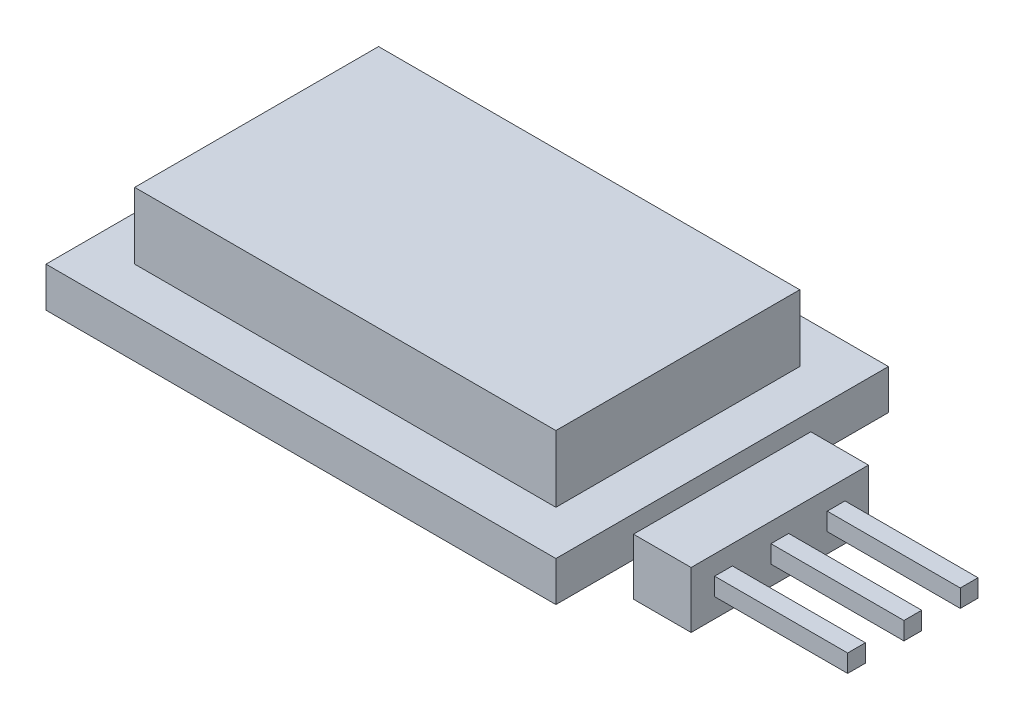
ISO-10303-21;
HEADER;
FILE_DESCRIPTION(('STEP AP214'),'2;1');
FILE_NAME('part.step','',(''),(''),'','','');
FILE_SCHEMA(('AUTOMOTIVE_DESIGN { 1 0 10303 214 1 1 1 1 }'));
ENDSEC;
DATA;
#1=APPLICATION_CONTEXT('core data for automotive mechanical design processes');
#2=APPLICATION_PROTOCOL_DEFINITION('international standard','automotive_design',2000,#1);
#3=PRODUCT_CONTEXT('',#1,'mechanical');
#4=PRODUCT('Part','Part','',(#3));
#5=PRODUCT_RELATED_PRODUCT_CATEGORY('part','',(#4));
#6=PRODUCT_DEFINITION_FORMATION('','',#4);
#7=PRODUCT_DEFINITION_CONTEXT('part definition',#1,'design');
#8=PRODUCT_DEFINITION('design','',#6,#7);
#9=PRODUCT_DEFINITION_SHAPE('','',#8);
#10=(LENGTH_UNIT() NAMED_UNIT(*) SI_UNIT(.MILLI.,.METRE.));
#11=(NAMED_UNIT(*) PLANE_ANGLE_UNIT() SI_UNIT($,.RADIAN.));
#12=(NAMED_UNIT(*) SI_UNIT($,.STERADIAN.) SOLID_ANGLE_UNIT());
#13=UNCERTAINTY_MEASURE_WITH_UNIT(LENGTH_MEASURE(1.E-05),#10,'distance_accuracy_value','');
#14=(GEOMETRIC_REPRESENTATION_CONTEXT(3) GLOBAL_UNCERTAINTY_ASSIGNED_CONTEXT((#13)) GLOBAL_UNIT_ASSIGNED_CONTEXT((#10,
#11,#12)) REPRESENTATION_CONTEXT('',''));
#15=CARTESIAN_POINT('',(0.,0.,0.));
#16=DIRECTION('',(0.,0.,1.));
#17=DIRECTION('',(1.,0.,0.));
#18=AXIS2_PLACEMENT_3D('',#15,#16,#17);
#19=CARTESIAN_POINT('',(25.6,0.,0.));
#20=DIRECTION('',(1.,0.,0.));
#21=DIRECTION('',(0.,0.,-1.));
#22=AXIS2_PLACEMENT_3D('',#19,#20,#21);
#23=PLANE('',#22);
#24=DIRECTION('',(0.,-1.,0.));
#25=VECTOR('',#24,1.);
#26=CARTESIAN_POINT('',(25.6,1.,-3.5));
#27=LINE('',#26,#25);
#28=CARTESIAN_POINT('',(25.6,1.,-3.5));
#29=VERTEX_POINT('',#28);
#30=CARTESIAN_POINT('',(25.6,-1.54,-3.5));
#31=VERTEX_POINT('',#30);
#32=EDGE_CURVE('E324',#29,#31,#27,.T.);
#33=ORIENTED_EDGE('',*,*,#32,.T.);
#34=DIRECTION('',(0.,0.,-1.));
#35=VECTOR('',#34,1.);
#36=CARTESIAN_POINT('',(25.6,-1.54,-3.5));
#37=LINE('',#36,#35);
#38=CARTESIAN_POINT('',(25.6,-1.54,-11.5));
#39=VERTEX_POINT('',#38);
#40=EDGE_CURVE('E328',#31,#39,#37,.T.);
#41=ORIENTED_EDGE('',*,*,#40,.T.);
#42=DIRECTION('',(0.,1.,0.));
#43=VECTOR('',#42,1.);
#44=CARTESIAN_POINT('',(25.6,1.,-11.5));
#45=LINE('',#44,#43);
#46=CARTESIAN_POINT('',(25.6,1.,-11.5));
#47=VERTEX_POINT('',#46);
#48=EDGE_CURVE('E332',#39,#47,#45,.T.);
#49=ORIENTED_EDGE('',*,*,#48,.T.);
#50=DIRECTION('',(0.,0.,1.));
#51=VECTOR('',#50,1.);
#52=CARTESIAN_POINT('',(25.6,1.,-3.5));
#53=LINE('',#52,#51);
#54=EDGE_CURVE('E335',#47,#29,#53,.T.);
#55=ORIENTED_EDGE('',*,*,#54,.T.);
#56=EDGE_LOOP('',(#33,#41,#49,#55));
#57=FACE_BOUND('',#56,.T.);
#58=DIRECTION('',(0.,0.,1.));
#59=VECTOR('',#58,1.);
#60=CARTESIAN_POINT('',(25.6,0.13,-7.1));
#61=LINE('',#60,#59);
#62=CARTESIAN_POINT('',(25.6,0.13,-7.9));
#63=VERTEX_POINT('',#62);
#64=CARTESIAN_POINT('',(25.6,0.13,-7.1));
#65=VERTEX_POINT('',#64);
#66=EDGE_CURVE('E301',#63,#65,#61,.T.);
#67=ORIENTED_EDGE('',*,*,#66,.F.);
#68=DIRECTION('',(0.,1.,0.));
#69=VECTOR('',#68,1.);
#70=CARTESIAN_POINT('',(25.6,0.13,-7.9));
#71=LINE('',#70,#69);
#72=CARTESIAN_POINT('',(25.6,-0.67,-7.9));
#73=VERTEX_POINT('',#72);
#74=EDGE_CURVE('E282',#73,#63,#71,.T.);
#75=ORIENTED_EDGE('',*,*,#74,.F.);
#76=DIRECTION('',(0.,0.,-1.));
#77=VECTOR('',#76,1.);
#78=CARTESIAN_POINT('',(25.6,-0.67,-7.1));
#79=LINE('',#78,#77);
#80=CARTESIAN_POINT('',(25.6,-0.67,-7.1));
#81=VERTEX_POINT('',#80);
#82=EDGE_CURVE('E288',#81,#73,#79,.T.);
#83=ORIENTED_EDGE('',*,*,#82,.F.);
#84=DIRECTION('',(0.,-1.,0.));
#85=VECTOR('',#84,1.);
#86=CARTESIAN_POINT('',(25.6,0.13,-7.1));
#87=LINE('',#86,#85);
#88=EDGE_CURVE('E304',#65,#81,#87,.T.);
#89=ORIENTED_EDGE('',*,*,#88,.F.);
#90=EDGE_LOOP('',(#67,#75,#83,#89));
#91=FACE_BOUND('',#90,.T.);
#92=DIRECTION('',(0.,1.,0.));
#93=VECTOR('',#92,1.);
#94=CARTESIAN_POINT('',(25.6,0.13,-10.44));
#95=LINE('',#94,#93);
#96=CARTESIAN_POINT('',(25.6,-0.67,-10.44));
#97=VERTEX_POINT('',#96);
#98=CARTESIAN_POINT('',(25.6,0.13,-10.44));
#99=VERTEX_POINT('',#98);
#100=EDGE_CURVE('E243',#97,#99,#95,.T.);
#101=ORIENTED_EDGE('',*,*,#100,.F.);
#102=DIRECTION('',(0.,0.,-1.));
#103=VECTOR('',#102,1.);
#104=CARTESIAN_POINT('',(25.6,-0.67,-9.64));
#105=LINE('',#104,#103);
#106=CARTESIAN_POINT('',(25.6,-0.67,-9.64));
#107=VERTEX_POINT('',#106);
#108=EDGE_CURVE('E238',#107,#97,#105,.T.);
#109=ORIENTED_EDGE('',*,*,#108,.F.);
#110=DIRECTION('',(0.,-1.,0.));
#111=VECTOR('',#110,1.);
#112=CARTESIAN_POINT('',(25.6,0.13,-9.64));
#113=LINE('',#112,#111);
#114=CARTESIAN_POINT('',(25.6,0.13,-9.64));
#115=VERTEX_POINT('',#114);
#116=EDGE_CURVE('E253',#115,#107,#113,.T.);
#117=ORIENTED_EDGE('',*,*,#116,.F.);
#118=DIRECTION('',(0.,0.,1.));
#119=VECTOR('',#118,1.);
#120=CARTESIAN_POINT('',(25.6,0.13,-9.64));
#121=LINE('',#120,#119);
#122=EDGE_CURVE('E265',#99,#115,#121,.T.);
#123=ORIENTED_EDGE('',*,*,#122,.F.);
#124=EDGE_LOOP('',(#101,#109,#117,#123));
#125=FACE_BOUND('',#124,.T.);
#126=DIRECTION('',(0.,1.,0.));
#127=VECTOR('',#126,1.);
#128=CARTESIAN_POINT('',(25.6,0.129999999999982,-5.36));
#129=LINE('',#128,#127);
#130=CARTESIAN_POINT('',(25.6,-0.670000000000018,-5.36));
#131=VERTEX_POINT('',#130);
#132=CARTESIAN_POINT('',(25.6,0.129999999999982,-5.36));
#133=VERTEX_POINT('',#132);
#134=EDGE_CURVE('E503',#131,#133,#129,.T.);
#135=ORIENTED_EDGE('',*,*,#134,.F.);
#136=DIRECTION('',(0.,0.,-1.));
#137=VECTOR('',#136,1.);
#138=CARTESIAN_POINT('',(25.6,-0.670000000000018,-4.56));
#139=LINE('',#138,#137);
#140=CARTESIAN_POINT('',(25.6,-0.670000000000018,-4.56));
#141=VERTEX_POINT('',#140);
#142=EDGE_CURVE('E235',#141,#131,#139,.T.);
#143=ORIENTED_EDGE('',*,*,#142,.F.);
#144=DIRECTION('',(0.,-1.,0.));
#145=VECTOR('',#144,1.);
#146=CARTESIAN_POINT('',(25.6,0.129999999999982,-4.56));
#147=LINE('',#146,#145);
#148=CARTESIAN_POINT('',(25.6,0.129999999999982,-4.56));
#149=VERTEX_POINT('',#148);
#150=EDGE_CURVE('E231',#149,#141,#147,.T.);
#151=ORIENTED_EDGE('',*,*,#150,.F.);
#152=DIRECTION('',(0.,0.,1.));
#153=VECTOR('',#152,1.);
#154=CARTESIAN_POINT('',(25.6,0.129999999999982,-4.56));
#155=LINE('',#154,#153);
#156=EDGE_CURVE('E505',#133,#149,#155,.T.);
#157=ORIENTED_EDGE('',*,*,#156,.F.);
#158=EDGE_LOOP('',(#135,#143,#151,#157));
#159=FACE_BOUND('',#158,.T.);
#160=ADVANCED_FACE('F39',(#57,#91,#125,#159),#23,.T.);
#161=CARTESIAN_POINT('',(23.,1.8,0.));
#162=DIRECTION('',(-1.,0.,0.));
#163=DIRECTION('',(0.,0.,1.));
#164=AXIS2_PLACEMENT_3D('',#161,#162,#163);
#165=PLANE('',#164);
#166=DIRECTION('',(0.,-1.,0.));
#167=VECTOR('',#166,1.);
#168=CARTESIAN_POINT('',(23.,1.,-3.5));
#169=LINE('',#168,#167);
#170=CARTESIAN_POINT('',(23.,1.,-3.5));
#171=VERTEX_POINT('',#170);
#172=CARTESIAN_POINT('',(23.,0.,-3.5));
#173=VERTEX_POINT('',#172);
#174=EDGE_CURVE('E339',#171,#173,#169,.T.);
#175=ORIENTED_EDGE('',*,*,#174,.F.);
#176=DIRECTION('',(0.,0.,1.));
#177=VECTOR('',#176,1.);
#178=CARTESIAN_POINT('',(23.,1.,-3.5));
#179=LINE('',#178,#177);
#180=CARTESIAN_POINT('',(23.,1.,-11.5));
#181=VERTEX_POINT('',#180);
#182=EDGE_CURVE('E329',#181,#171,#179,.T.);
#183=ORIENTED_EDGE('',*,*,#182,.F.);
#184=DIRECTION('',(0.,1.,0.));
#185=VECTOR('',#184,1.);
#186=CARTESIAN_POINT('',(23.,1.,-11.5));
#187=LINE('',#186,#185);
#188=CARTESIAN_POINT('',(23.,0.,-11.5));
#189=VERTEX_POINT('',#188);
#190=EDGE_CURVE('E11',#189,#181,#187,.T.);
#191=ORIENTED_EDGE('',*,*,#190,.F.);
#192=DIRECTION('',(0.,0.,-1.));
#193=VECTOR('',#192,1.);
#194=CARTESIAN_POINT('',(23.,0.,0.));
#195=LINE('',#194,#193);
#196=CARTESIAN_POINT('',(23.,0.,-15.));
#197=VERTEX_POINT('',#196);
#198=EDGE_CURVE('E433',#189,#197,#195,.T.);
#199=ORIENTED_EDGE('',*,*,#198,.T.);
#200=DIRECTION('',(0.,-1.,0.));
#201=VECTOR('',#200,1.);
#202=CARTESIAN_POINT('',(23.,1.8,-15.));
#203=LINE('',#202,#201);
#204=CARTESIAN_POINT('',(23.,1.8,-15.));
#205=VERTEX_POINT('',#204);
#206=EDGE_CURVE('E444',#205,#197,#203,.T.);
#207=ORIENTED_EDGE('',*,*,#206,.F.);
#208=DIRECTION('',(0.,0.,-1.));
#209=VECTOR('',#208,1.);
#210=CARTESIAN_POINT('',(23.,1.8,0.));
#211=LINE('',#210,#209);
#212=CARTESIAN_POINT('',(23.,1.8,0.));
#213=VERTEX_POINT('',#212);
#214=EDGE_CURVE('E420',#213,#205,#211,.T.);
#215=ORIENTED_EDGE('',*,*,#214,.F.);
#216=DIRECTION('',(0.,-1.,0.));
#217=VECTOR('',#216,1.);
#218=CARTESIAN_POINT('',(23.,1.8,0.));
#219=LINE('',#218,#217);
#220=CARTESIAN_POINT('',(23.,0.,0.));
#221=VERTEX_POINT('',#220);
#222=EDGE_CURVE('E447',#213,#221,#219,.T.);
#223=ORIENTED_EDGE('',*,*,#222,.T.);
#224=EDGE_CURVE('E434',#221,#173,#195,.T.);
#225=ORIENTED_EDGE('',*,*,#224,.T.);
#226=EDGE_LOOP('',(#175,#183,#191,#199,#207,#215,#223,#225));
#227=FACE_BOUND('',#226,.T.);
#228=ADVANCED_FACE('F469',(#227),#165,.F.);
#229=CARTESIAN_POINT('',(0.,1.8,0.));
#230=DIRECTION('',(0.,-1.,0.));
#231=DIRECTION('',(0.,0.,-1.));
#232=AXIS2_PLACEMENT_3D('',#229,#230,#231);
#233=PLANE('',#232);
#234=DIRECTION('',(0.,0.,1.));
#235=VECTOR('',#234,1.);
#236=CARTESIAN_POINT('',(0.,1.8,0.));
#237=LINE('',#236,#235);
#238=CARTESIAN_POINT('',(0.,1.8,-15.));
#239=VERTEX_POINT('',#238);
#240=CARTESIAN_POINT('',(0.,1.8,0.));
#241=VERTEX_POINT('',#240);
#242=EDGE_CURVE('E412',#239,#241,#237,.T.);
#243=ORIENTED_EDGE('',*,*,#242,.T.);
#244=DIRECTION('',(1.,0.,0.));
#245=VECTOR('',#244,1.);
#246=CARTESIAN_POINT('',(0.,1.8,0.));
#247=LINE('',#246,#245);
#248=EDGE_CURVE('E416',#241,#213,#247,.T.);
#249=ORIENTED_EDGE('',*,*,#248,.T.);
#250=ORIENTED_EDGE('',*,*,#214,.T.);
#251=DIRECTION('',(-1.,0.,0.));
#252=VECTOR('',#251,1.);
#253=CARTESIAN_POINT('',(0.,1.8,-15.));
#254=LINE('',#253,#252);
#255=EDGE_CURVE('E423',#205,#239,#254,.T.);
#256=ORIENTED_EDGE('',*,*,#255,.T.);
#257=EDGE_LOOP('',(#243,#249,#250,#256));
#258=FACE_BOUND('',#257,.T.);
#259=DIRECTION('',(0.,0.,1.));
#260=VECTOR('',#259,1.);
#261=CARTESIAN_POINT('',(2.,1.8,-2.));
#262=LINE('',#261,#260);
#263=CARTESIAN_POINT('',(2.,1.8,-13.));
#264=VERTEX_POINT('',#263);
#265=CARTESIAN_POINT('',(2.,1.8,-2.));
#266=VERTEX_POINT('',#265);
#267=EDGE_CURVE('E366',#264,#266,#262,.T.);
#268=ORIENTED_EDGE('',*,*,#267,.F.);
#269=DIRECTION('',(-1.,0.,0.));
#270=VECTOR('',#269,1.);
#271=CARTESIAN_POINT('',(2.,1.8,-13.));
#272=LINE('',#271,#270);
#273=CARTESIAN_POINT('',(21.,1.8,-13.));
#274=VERTEX_POINT('',#273);
#275=EDGE_CURVE('E372',#274,#264,#272,.T.);
#276=ORIENTED_EDGE('',*,*,#275,.F.);
#277=DIRECTION('',(0.,0.,-1.));
#278=VECTOR('',#277,1.);
#279=CARTESIAN_POINT('',(21.,1.8,-2.));
#280=LINE('',#279,#278);
#281=CARTESIAN_POINT('',(21.,1.8,-2.));
#282=VERTEX_POINT('',#281);
#283=EDGE_CURVE('E389',#282,#274,#280,.T.);
#284=ORIENTED_EDGE('',*,*,#283,.F.);
#285=DIRECTION('',(1.,0.,0.));
#286=VECTOR('',#285,1.);
#287=CARTESIAN_POINT('',(2.,1.8,-2.));
#288=LINE('',#287,#286);
#289=EDGE_CURVE('E385',#266,#282,#288,.T.);
#290=ORIENTED_EDGE('',*,*,#289,.F.);
#291=EDGE_LOOP('',(#268,#276,#284,#290));
#292=FACE_BOUND('',#291,.T.);
#293=ADVANCED_FACE('F607',(#258,#292),#233,.F.);
#294=CARTESIAN_POINT('',(0.,1.8,0.));
#295=DIRECTION('',(1.,0.,0.));
#296=DIRECTION('',(0.,0.,-1.));
#297=AXIS2_PLACEMENT_3D('',#294,#295,#296);
#298=PLANE('',#297);
#299=DIRECTION('',(0.,0.,1.));
#300=VECTOR('',#299,1.);
#301=CARTESIAN_POINT('',(0.,0.,0.));
#302=LINE('',#301,#300);
#303=CARTESIAN_POINT('',(0.,0.,-15.));
#304=VERTEX_POINT('',#303);
#305=CARTESIAN_POINT('',(0.,0.,0.));
#306=VERTEX_POINT('',#305);
#307=EDGE_CURVE('E411',#304,#306,#302,.T.);
#308=ORIENTED_EDGE('',*,*,#307,.T.);
#309=DIRECTION('',(0.,-1.,0.));
#310=VECTOR('',#309,1.);
#311=CARTESIAN_POINT('',(0.,1.8,0.));
#312=LINE('',#311,#310);
#313=EDGE_CURVE('E43',#241,#306,#312,.T.);
#314=ORIENTED_EDGE('',*,*,#313,.F.);
#315=ORIENTED_EDGE('',*,*,#242,.F.);
#316=DIRECTION('',(0.,-1.,0.));
#317=VECTOR('',#316,1.);
#318=CARTESIAN_POINT('',(0.,1.8,-15.));
#319=LINE('',#318,#317);
#320=EDGE_CURVE('E426',#239,#304,#319,.T.);
#321=ORIENTED_EDGE('',*,*,#320,.T.);
#322=EDGE_LOOP('',(#308,#314,#315,#321));
#323=FACE_BOUND('',#322,.T.);
#324=ADVANCED_FACE('F41',(#323),#298,.F.);
#325=CARTESIAN_POINT('',(0.,1.8,0.));
#326=DIRECTION('',(0.,0.,-1.));
#327=DIRECTION('',(-1.,0.,0.));
#328=AXIS2_PLACEMENT_3D('',#325,#326,#327);
#329=PLANE('',#328);
#330=DIRECTION('',(1.,0.,0.));
#331=VECTOR('',#330,1.);
#332=CARTESIAN_POINT('',(0.,0.,0.));
#333=LINE('',#332,#331);
#334=EDGE_CURVE('E430',#306,#221,#333,.T.);
#335=ORIENTED_EDGE('',*,*,#334,.T.);
#336=ORIENTED_EDGE('',*,*,#222,.F.);
#337=ORIENTED_EDGE('',*,*,#248,.F.);
#338=ORIENTED_EDGE('',*,*,#313,.T.);
#339=EDGE_LOOP('',(#335,#336,#337,#338));
#340=FACE_BOUND('',#339,.T.);
#341=ADVANCED_FACE('F458',(#340),#329,.F.);
#342=CARTESIAN_POINT('',(0.,1.8,-15.));
#343=DIRECTION('',(0.,0.,1.));
#344=DIRECTION('',(1.,0.,0.));
#345=AXIS2_PLACEMENT_3D('',#342,#343,#344);
#346=PLANE('',#345);
#347=DIRECTION('',(-1.,0.,0.));
#348=VECTOR('',#347,1.);
#349=CARTESIAN_POINT('',(0.,0.,-15.));
#350=LINE('',#349,#348);
#351=EDGE_CURVE('E417',#197,#304,#350,.T.);
#352=ORIENTED_EDGE('',*,*,#351,.T.);
#353=ORIENTED_EDGE('',*,*,#320,.F.);
#354=ORIENTED_EDGE('',*,*,#255,.F.);
#355=ORIENTED_EDGE('',*,*,#206,.T.);
#356=EDGE_LOOP('',(#352,#353,#354,#355));
#357=FACE_BOUND('',#356,.T.);
#358=ADVANCED_FACE('F613',(#357),#346,.F.);
#359=CARTESIAN_POINT('',(0.,0.,0.));
#360=DIRECTION('',(0.,-1.,0.));
#361=DIRECTION('',(0.,0.,-1.));
#362=AXIS2_PLACEMENT_3D('',#359,#360,#361);
#363=PLANE('',#362);
#364=ORIENTED_EDGE('',*,*,#307,.F.);
#365=ORIENTED_EDGE('',*,*,#351,.F.);
#366=ORIENTED_EDGE('',*,*,#198,.F.);
#367=EDGE_CURVE('E438',#173,#189,#195,.T.);
#368=ORIENTED_EDGE('',*,*,#367,.F.);
#369=ORIENTED_EDGE('',*,*,#224,.F.);
#370=ORIENTED_EDGE('',*,*,#334,.F.);
#371=EDGE_LOOP('',(#364,#365,#366,#368,#369,#370));
#372=FACE_BOUND('',#371,.T.);
#373=ADVANCED_FACE('F465',(#372),#363,.T.);
#374=CARTESIAN_POINT('',(2.,4.8,-2.));
#375=DIRECTION('',(1.,0.,0.));
#376=DIRECTION('',(0.,0.,-1.));
#377=AXIS2_PLACEMENT_3D('',#374,#375,#376);
#378=PLANE('',#377);
#379=ORIENTED_EDGE('',*,*,#267,.T.);
#380=DIRECTION('',(0.,-1.,0.));
#381=VECTOR('',#380,1.);
#382=CARTESIAN_POINT('',(2.,4.8,-2.));
#383=LINE('',#382,#381);
#384=CARTESIAN_POINT('',(2.,4.8,-2.));
#385=VERTEX_POINT('',#384);
#386=EDGE_CURVE('E407',#385,#266,#383,.T.);
#387=ORIENTED_EDGE('',*,*,#386,.F.);
#388=DIRECTION('',(0.,0.,1.));
#389=VECTOR('',#388,1.);
#390=CARTESIAN_POINT('',(2.,4.8,-2.));
#391=LINE('',#390,#389);
#392=CARTESIAN_POINT('',(2.,4.8,-13.));
#393=VERTEX_POINT('',#392);
#394=EDGE_CURVE('E367',#393,#385,#391,.T.);
#395=ORIENTED_EDGE('',*,*,#394,.F.);
#396=DIRECTION('',(0.,-1.,0.));
#397=VECTOR('',#396,1.);
#398=CARTESIAN_POINT('',(2.,4.8,-13.));
#399=LINE('',#398,#397);
#400=EDGE_CURVE('E381',#393,#264,#399,.T.);
#401=ORIENTED_EDGE('',*,*,#400,.T.);
#402=EDGE_LOOP('',(#379,#387,#395,#401));
#403=FACE_BOUND('',#402,.T.);
#404=ADVANCED_FACE('F602',(#403),#378,.F.);
#405=CARTESIAN_POINT('',(2.,4.8,-2.));
#406=DIRECTION('',(0.,0.,-1.));
#407=DIRECTION('',(-1.,0.,0.));
#408=AXIS2_PLACEMENT_3D('',#405,#406,#407);
#409=PLANE('',#408);
#410=ORIENTED_EDGE('',*,*,#289,.T.);
#411=DIRECTION('',(0.,-1.,0.));
#412=VECTOR('',#411,1.);
#413=CARTESIAN_POINT('',(21.,4.8,-2.));
#414=LINE('',#413,#412);
#415=CARTESIAN_POINT('',(21.,4.8,-2.));
#416=VERTEX_POINT('',#415);
#417=EDGE_CURVE('E403',#416,#282,#414,.T.);
#418=ORIENTED_EDGE('',*,*,#417,.F.);
#419=DIRECTION('',(1.,0.,0.));
#420=VECTOR('',#419,1.);
#421=CARTESIAN_POINT('',(2.,4.8,-2.));
#422=LINE('',#421,#420);
#423=EDGE_CURVE('E371',#385,#416,#422,.T.);
#424=ORIENTED_EDGE('',*,*,#423,.F.);
#425=ORIENTED_EDGE('',*,*,#386,.T.);
#426=EDGE_LOOP('',(#410,#418,#424,#425));
#427=FACE_BOUND('',#426,.T.);
#428=ADVANCED_FACE('F598',(#427),#409,.F.);
#429=CARTESIAN_POINT('',(21.,4.8,-2.));
#430=DIRECTION('',(-1.,0.,0.));
#431=DIRECTION('',(0.,0.,1.));
#432=AXIS2_PLACEMENT_3D('',#429,#430,#431);
#433=PLANE('',#432);
#434=ORIENTED_EDGE('',*,*,#283,.T.);
#435=DIRECTION('',(0.,-1.,0.));
#436=VECTOR('',#435,1.);
#437=CARTESIAN_POINT('',(21.,4.8,-13.));
#438=LINE('',#437,#436);
#439=CARTESIAN_POINT('',(21.,4.8,-13.));
#440=VERTEX_POINT('',#439);
#441=EDGE_CURVE('E399',#440,#274,#438,.T.);
#442=ORIENTED_EDGE('',*,*,#441,.F.);
#443=DIRECTION('',(0.,0.,-1.));
#444=VECTOR('',#443,1.);
#445=CARTESIAN_POINT('',(21.,4.8,-2.));
#446=LINE('',#445,#444);
#447=EDGE_CURVE('E375',#416,#440,#446,.T.);
#448=ORIENTED_EDGE('',*,*,#447,.F.);
#449=ORIENTED_EDGE('',*,*,#417,.T.);
#450=EDGE_LOOP('',(#434,#442,#448,#449));
#451=FACE_BOUND('',#450,.T.);
#452=ADVANCED_FACE('F594',(#451),#433,.F.);
#453=CARTESIAN_POINT('',(2.,4.8,-13.));
#454=DIRECTION('',(0.,0.,1.));
#455=DIRECTION('',(1.,0.,0.));
#456=AXIS2_PLACEMENT_3D('',#453,#454,#455);
#457=PLANE('',#456);
#458=ORIENTED_EDGE('',*,*,#275,.T.);
#459=ORIENTED_EDGE('',*,*,#400,.F.);
#460=DIRECTION('',(-1.,0.,0.));
#461=VECTOR('',#460,1.);
#462=CARTESIAN_POINT('',(2.,4.8,-13.));
#463=LINE('',#462,#461);
#464=EDGE_CURVE('E378',#440,#393,#463,.T.);
#465=ORIENTED_EDGE('',*,*,#464,.F.);
#466=ORIENTED_EDGE('',*,*,#441,.T.);
#467=EDGE_LOOP('',(#458,#459,#465,#466));
#468=FACE_BOUND('',#467,.T.);
#469=ADVANCED_FACE('F590',(#468),#457,.F.);
#470=CARTESIAN_POINT('',(0.,4.8,0.));
#471=DIRECTION('',(0.,-1.,0.));
#472=DIRECTION('',(0.,0.,-1.));
#473=AXIS2_PLACEMENT_3D('',#470,#471,#472);
#474=PLANE('',#473);
#475=ORIENTED_EDGE('',*,*,#394,.T.);
#476=ORIENTED_EDGE('',*,*,#423,.T.);
#477=ORIENTED_EDGE('',*,*,#447,.T.);
#478=ORIENTED_EDGE('',*,*,#464,.T.);
#479=EDGE_LOOP('',(#475,#476,#477,#478));
#480=FACE_BOUND('',#479,.T.);
#481=ADVANCED_FACE('F579',(#480),#474,.F.);
#482=CARTESIAN_POINT('',(23.,0.,0.));
#483=DIRECTION('',(1.,0.,0.));
#484=DIRECTION('',(0.,0.,-1.));
#485=AXIS2_PLACEMENT_3D('',#482,#483,#484);
#486=PLANE('',#485);
#487=CARTESIAN_POINT('',(23.,-1.54,-3.5));
#488=VERTEX_POINT('',#487);
#489=EDGE_CURVE('E323',#173,#488,#169,.T.);
#490=ORIENTED_EDGE('',*,*,#489,.F.);
#491=ORIENTED_EDGE('',*,*,#367,.T.);
#492=CARTESIAN_POINT('',(23.,-1.54,-11.5));
#493=VERTEX_POINT('',#492);
#494=EDGE_CURVE('E50',#493,#189,#187,.T.);
#495=ORIENTED_EDGE('',*,*,#494,.F.);
#496=DIRECTION('',(0.,0.,-1.));
#497=VECTOR('',#496,1.);
#498=CARTESIAN_POINT('',(23.,-1.54,-3.5));
#499=LINE('',#498,#497);
#500=EDGE_CURVE('E343',#488,#493,#499,.T.);
#501=ORIENTED_EDGE('',*,*,#500,.F.);
#502=EDGE_LOOP('',(#490,#491,#495,#501));
#503=FACE_BOUND('',#502,.T.);
#504=ADVANCED_FACE('F472',(#503),#486,.F.);
#505=CARTESIAN_POINT('',(25.6,1.,-3.5));
#506=DIRECTION('',(0.,0.,-1.));
#507=DIRECTION('',(0.,1.,0.));
#508=AXIS2_PLACEMENT_3D('',#505,#506,#507);
#509=PLANE('',#508);
#510=ORIENTED_EDGE('',*,*,#174,.T.);
#511=ORIENTED_EDGE('',*,*,#489,.T.);
#512=DIRECTION('',(-1.,0.,0.));
#513=VECTOR('',#512,1.);
#514=CARTESIAN_POINT('',(25.6,-1.54,-3.5));
#515=LINE('',#514,#513);
#516=EDGE_CURVE('E362',#31,#488,#515,.T.);
#517=ORIENTED_EDGE('',*,*,#516,.F.);
#518=ORIENTED_EDGE('',*,*,#32,.F.);
#519=DIRECTION('',(-1.,0.,0.));
#520=VECTOR('',#519,1.);
#521=CARTESIAN_POINT('',(25.6,1.,-3.5));
#522=LINE('',#521,#520);
#523=EDGE_CURVE('E338',#29,#171,#522,.T.);
#524=ORIENTED_EDGE('',*,*,#523,.T.);
#525=EDGE_LOOP('',(#510,#511,#517,#518,#524));
#526=FACE_BOUND('',#525,.T.);
#527=ADVANCED_FACE('F477',(#526),#509,.F.);
#528=CARTESIAN_POINT('',(25.6,-1.54,-3.5));
#529=DIRECTION('',(0.,1.,0.));
#530=DIRECTION('',(0.,0.,1.));
#531=AXIS2_PLACEMENT_3D('',#528,#529,#530);
#532=PLANE('',#531);
#533=ORIENTED_EDGE('',*,*,#500,.T.);
#534=DIRECTION('',(-1.,0.,0.));
#535=VECTOR('',#534,1.);
#536=CARTESIAN_POINT('',(25.6,-1.54,-11.5));
#537=LINE('',#536,#535);
#538=EDGE_CURVE('E358',#39,#493,#537,.T.);
#539=ORIENTED_EDGE('',*,*,#538,.F.);
#540=ORIENTED_EDGE('',*,*,#40,.F.);
#541=ORIENTED_EDGE('',*,*,#516,.T.);
#542=EDGE_LOOP('',(#533,#539,#540,#541));
#543=FACE_BOUND('',#542,.T.);
#544=ADVANCED_FACE('F489',(#543),#532,.F.);
#545=CARTESIAN_POINT('',(25.6,1.,-11.5));
#546=DIRECTION('',(0.,0.,1.));
#547=DIRECTION('',(1.,0.,0.));
#548=AXIS2_PLACEMENT_3D('',#545,#546,#547);
#549=PLANE('',#548);
#550=ORIENTED_EDGE('',*,*,#494,.T.);
#551=ORIENTED_EDGE('',*,*,#190,.T.);
#552=DIRECTION('',(-1.,0.,0.));
#553=VECTOR('',#552,1.);
#554=CARTESIAN_POINT('',(25.6,1.,-11.5));
#555=LINE('',#554,#553);
#556=EDGE_CURVE('E354',#47,#181,#555,.T.);
#557=ORIENTED_EDGE('',*,*,#556,.F.);
#558=ORIENTED_EDGE('',*,*,#48,.F.);
#559=ORIENTED_EDGE('',*,*,#538,.T.);
#560=EDGE_LOOP('',(#550,#551,#557,#558,#559));
#561=FACE_BOUND('',#560,.T.);
#562=ADVANCED_FACE('F485',(#561),#549,.F.);
#563=CARTESIAN_POINT('',(25.6,1.,-3.5));
#564=DIRECTION('',(0.,-1.,0.));
#565=DIRECTION('',(0.,0.,-1.));
#566=AXIS2_PLACEMENT_3D('',#563,#564,#565);
#567=PLANE('',#566);
#568=ORIENTED_EDGE('',*,*,#182,.T.);
#569=ORIENTED_EDGE('',*,*,#523,.F.);
#570=ORIENTED_EDGE('',*,*,#54,.F.);
#571=ORIENTED_EDGE('',*,*,#556,.T.);
#572=EDGE_LOOP('',(#568,#569,#570,#571));
#573=FACE_BOUND('',#572,.T.);
#574=ADVANCED_FACE('F482',(#573),#567,.F.);
#575=CARTESIAN_POINT('',(31.6,0.13,-7.9));
#576=DIRECTION('',(0.,0.,1.));
#577=DIRECTION('',(1.,0.,0.));
#578=AXIS2_PLACEMENT_3D('',#575,#576,#577);
#579=PLANE('',#578);
#580=ORIENTED_EDGE('',*,*,#74,.T.);
#581=DIRECTION('',(-1.,0.,0.));
#582=VECTOR('',#581,1.);
#583=CARTESIAN_POINT('',(31.6,0.13,-7.9));
#584=LINE('',#583,#582);
#585=CARTESIAN_POINT('',(31.6,0.13,-7.9));
#586=VERTEX_POINT('',#585);
#587=EDGE_CURVE('E320',#586,#63,#584,.T.);
#588=ORIENTED_EDGE('',*,*,#587,.F.);
#589=DIRECTION('',(0.,1.,0.));
#590=VECTOR('',#589,1.);
#591=CARTESIAN_POINT('',(31.6,0.13,-7.9));
#592=LINE('',#591,#590);
#593=CARTESIAN_POINT('',(31.6,-0.67,-7.9));
#594=VERTEX_POINT('',#593);
#595=EDGE_CURVE('E283',#594,#586,#592,.T.);
#596=ORIENTED_EDGE('',*,*,#595,.F.);
#597=DIRECTION('',(-1.,0.,0.));
#598=VECTOR('',#597,1.);
#599=CARTESIAN_POINT('',(31.6,-0.67,-7.9));
#600=LINE('',#599,#598);
#601=EDGE_CURVE('E297',#594,#73,#600,.T.);
#602=ORIENTED_EDGE('',*,*,#601,.T.);
#603=EDGE_LOOP('',(#580,#588,#596,#602));
#604=FACE_BOUND('',#603,.T.);
#605=ADVANCED_FACE('F572',(#604),#579,.F.);
#606=CARTESIAN_POINT('',(31.6,0.13,-7.1));
#607=DIRECTION('',(0.,-1.,0.));
#608=DIRECTION('',(0.,0.,-1.));
#609=AXIS2_PLACEMENT_3D('',#606,#607,#608);
#610=PLANE('',#609);
#611=ORIENTED_EDGE('',*,*,#66,.T.);
#612=DIRECTION('',(-1.,0.,0.));
#613=VECTOR('',#612,1.);
#614=CARTESIAN_POINT('',(31.6,0.13,-7.1));
#615=LINE('',#614,#613);
#616=CARTESIAN_POINT('',(31.6,0.13,-7.1));
#617=VERTEX_POINT('',#616);
#618=EDGE_CURVE('E316',#617,#65,#615,.T.);
#619=ORIENTED_EDGE('',*,*,#618,.F.);
#620=DIRECTION('',(0.,0.,1.));
#621=VECTOR('',#620,1.);
#622=CARTESIAN_POINT('',(31.6,0.13,-7.1));
#623=LINE('',#622,#621);
#624=EDGE_CURVE('E287',#586,#617,#623,.T.);
#625=ORIENTED_EDGE('',*,*,#624,.F.);
#626=ORIENTED_EDGE('',*,*,#587,.T.);
#627=EDGE_LOOP('',(#611,#619,#625,#626));
#628=FACE_BOUND('',#627,.T.);
#629=ADVANCED_FACE('F568',(#628),#610,.F.);
#630=CARTESIAN_POINT('',(31.6,0.13,-7.1));
#631=DIRECTION('',(0.,0.,-1.));
#632=DIRECTION('',(-1.,0.,0.));
#633=AXIS2_PLACEMENT_3D('',#630,#631,#632);
#634=PLANE('',#633);
#635=ORIENTED_EDGE('',*,*,#88,.T.);
#636=DIRECTION('',(-1.,0.,0.));
#637=VECTOR('',#636,1.);
#638=CARTESIAN_POINT('',(31.6,-0.67,-7.1));
#639=LINE('',#638,#637);
#640=CARTESIAN_POINT('',(31.6,-0.67,-7.1));
#641=VERTEX_POINT('',#640);
#642=EDGE_CURVE('E313',#641,#81,#639,.T.);
#643=ORIENTED_EDGE('',*,*,#642,.F.);
#644=DIRECTION('',(0.,-1.,0.));
#645=VECTOR('',#644,1.);
#646=CARTESIAN_POINT('',(31.6,0.13,-7.1));
#647=LINE('',#646,#645);
#648=EDGE_CURVE('E291',#617,#641,#647,.T.);
#649=ORIENTED_EDGE('',*,*,#648,.F.);
#650=ORIENTED_EDGE('',*,*,#618,.T.);
#651=EDGE_LOOP('',(#635,#643,#649,#650));
#652=FACE_BOUND('',#651,.T.);
#653=ADVANCED_FACE('F564',(#652),#634,.F.);
#654=CARTESIAN_POINT('',(31.6,-0.67,-7.1));
#655=DIRECTION('',(0.,1.,0.));
#656=DIRECTION('',(0.,0.,1.));
#657=AXIS2_PLACEMENT_3D('',#654,#655,#656);
#658=PLANE('',#657);
#659=ORIENTED_EDGE('',*,*,#82,.T.);
#660=ORIENTED_EDGE('',*,*,#601,.F.);
#661=DIRECTION('',(0.,0.,-1.));
#662=VECTOR('',#661,1.);
#663=CARTESIAN_POINT('',(31.6,-0.67,-7.1));
#664=LINE('',#663,#662);
#665=EDGE_CURVE('E294',#641,#594,#664,.T.);
#666=ORIENTED_EDGE('',*,*,#665,.F.);
#667=ORIENTED_EDGE('',*,*,#642,.T.);
#668=EDGE_LOOP('',(#659,#660,#666,#667));
#669=FACE_BOUND('',#668,.T.);
#670=ADVANCED_FACE('F560',(#669),#658,.F.);
#671=CARTESIAN_POINT('',(31.6,0.,0.));
#672=DIRECTION('',(1.,0.,0.));
#673=DIRECTION('',(0.,0.,-1.));
#674=AXIS2_PLACEMENT_3D('',#671,#672,#673);
#675=PLANE('',#674);
#676=ORIENTED_EDGE('',*,*,#595,.T.);
#677=ORIENTED_EDGE('',*,*,#624,.T.);
#678=ORIENTED_EDGE('',*,*,#648,.T.);
#679=ORIENTED_EDGE('',*,*,#665,.T.);
#680=EDGE_LOOP('',(#676,#677,#678,#679));
#681=FACE_BOUND('',#680,.T.);
#682=ADVANCED_FACE('F556',(#681),#675,.T.);
#683=CARTESIAN_POINT('',(31.6,-0.67,-9.64));
#684=DIRECTION('',(0.,1.,0.));
#685=DIRECTION('',(0.,0.,1.));
#686=AXIS2_PLACEMENT_3D('',#683,#684,#685);
#687=PLANE('',#686);
#688=ORIENTED_EDGE('',*,*,#108,.T.);
#689=DIRECTION('',(-1.,0.,0.));
#690=VECTOR('',#689,1.);
#691=CARTESIAN_POINT('',(31.6,-0.67,-10.44));
#692=LINE('',#691,#690);
#693=CARTESIAN_POINT('',(31.6,-0.67,-10.44));
#694=VERTEX_POINT('',#693);
#695=EDGE_CURVE('E279',#694,#97,#692,.T.);
#696=ORIENTED_EDGE('',*,*,#695,.F.);
#697=DIRECTION('',(0.,0.,-1.));
#698=VECTOR('',#697,1.);
#699=CARTESIAN_POINT('',(31.6,-0.67,-9.64));
#700=LINE('',#699,#698);
#701=CARTESIAN_POINT('',(31.6,-0.67,-9.64));
#702=VERTEX_POINT('',#701);
#703=EDGE_CURVE('E248',#702,#694,#700,.T.);
#704=ORIENTED_EDGE('',*,*,#703,.F.);
#705=DIRECTION('',(-1.,0.,0.));
#706=VECTOR('',#705,1.);
#707=CARTESIAN_POINT('',(31.6,-0.67,-9.64));
#708=LINE('',#707,#706);
#709=EDGE_CURVE('E261',#702,#107,#708,.T.);
#710=ORIENTED_EDGE('',*,*,#709,.T.);
#711=EDGE_LOOP('',(#688,#696,#704,#710));
#712=FACE_BOUND('',#711,.T.);
#713=ADVANCED_FACE('F552',(#712),#687,.F.);
#714=CARTESIAN_POINT('',(31.6,0.13,-10.44));
#715=DIRECTION('',(0.,0.,1.));
#716=DIRECTION('',(1.,0.,0.));
#717=AXIS2_PLACEMENT_3D('',#714,#715,#716);
#718=PLANE('',#717);
#719=ORIENTED_EDGE('',*,*,#100,.T.);
#720=DIRECTION('',(-1.,0.,0.));
#721=VECTOR('',#720,1.);
#722=CARTESIAN_POINT('',(31.6,0.13,-10.44));
#723=LINE('',#722,#721);
#724=CARTESIAN_POINT('',(31.6,0.13,-10.44));
#725=VERTEX_POINT('',#724);
#726=EDGE_CURVE('E275',#725,#99,#723,.T.);
#727=ORIENTED_EDGE('',*,*,#726,.F.);
#728=DIRECTION('',(0.,1.,0.));
#729=VECTOR('',#728,1.);
#730=CARTESIAN_POINT('',(31.6,0.13,-10.44));
#731=LINE('',#730,#729);
#732=EDGE_CURVE('E252',#694,#725,#731,.T.);
#733=ORIENTED_EDGE('',*,*,#732,.F.);
#734=ORIENTED_EDGE('',*,*,#695,.T.);
#735=EDGE_LOOP('',(#719,#727,#733,#734));
#736=FACE_BOUND('',#735,.T.);
#737=ADVANCED_FACE('F548',(#736),#718,.F.);
#738=CARTESIAN_POINT('',(31.6,0.13,-9.64));
#739=DIRECTION('',(0.,-1.,0.));
#740=DIRECTION('',(0.,0.,-1.));
#741=AXIS2_PLACEMENT_3D('',#738,#739,#740);
#742=PLANE('',#741);
#743=ORIENTED_EDGE('',*,*,#122,.T.);
#744=DIRECTION('',(-1.,0.,0.));
#745=VECTOR('',#744,1.);
#746=CARTESIAN_POINT('',(31.6,0.13,-9.64));
#747=LINE('',#746,#745);
#748=CARTESIAN_POINT('',(31.6,0.13,-9.64));
#749=VERTEX_POINT('',#748);
#750=EDGE_CURVE('E65',#749,#115,#747,.T.);
#751=ORIENTED_EDGE('',*,*,#750,.F.);
#752=DIRECTION('',(0.,0.,1.));
#753=VECTOR('',#752,1.);
#754=CARTESIAN_POINT('',(31.6,0.13,-9.64));
#755=LINE('',#754,#753);
#756=EDGE_CURVE('E256',#725,#749,#755,.T.);
#757=ORIENTED_EDGE('',*,*,#756,.F.);
#758=ORIENTED_EDGE('',*,*,#726,.T.);
#759=EDGE_LOOP('',(#743,#751,#757,#758));
#760=FACE_BOUND('',#759,.T.);
#761=ADVANCED_FACE('F545',(#760),#742,.F.);
#762=CARTESIAN_POINT('',(31.6,0.13,-9.64));
#763=DIRECTION('',(0.,0.,-1.));
#764=DIRECTION('',(-1.,0.,0.));
#765=AXIS2_PLACEMENT_3D('',#762,#763,#764);
#766=PLANE('',#765);
#767=ORIENTED_EDGE('',*,*,#116,.T.);
#768=ORIENTED_EDGE('',*,*,#709,.F.);
#769=DIRECTION('',(0.,-1.,0.));
#770=VECTOR('',#769,1.);
#771=CARTESIAN_POINT('',(31.6,0.13,-9.64));
#772=LINE('',#771,#770);
#773=EDGE_CURVE('E259',#749,#702,#772,.T.);
#774=ORIENTED_EDGE('',*,*,#773,.F.);
#775=ORIENTED_EDGE('',*,*,#750,.T.);
#776=EDGE_LOOP('',(#767,#768,#774,#775));
#777=FACE_BOUND('',#776,.T.);
#778=ADVANCED_FACE('F541',(#777),#766,.F.);
#779=CARTESIAN_POINT('',(31.6,0.,0.));
#780=DIRECTION('',(-1.,0.,0.));
#781=DIRECTION('',(0.,0.,1.));
#782=AXIS2_PLACEMENT_3D('',#779,#780,#781);
#783=PLANE('',#782);
#784=ORIENTED_EDGE('',*,*,#703,.T.);
#785=ORIENTED_EDGE('',*,*,#732,.T.);
#786=ORIENTED_EDGE('',*,*,#756,.T.);
#787=ORIENTED_EDGE('',*,*,#773,.T.);
#788=EDGE_LOOP('',(#784,#785,#786,#787));
#789=FACE_BOUND('',#788,.T.);
#790=ADVANCED_FACE('F538',(#789),#783,.F.);
#791=CARTESIAN_POINT('',(31.6,-0.670000000000018,-4.56));
#792=DIRECTION('',(0.,1.,0.));
#793=DIRECTION('',(0.,0.,1.));
#794=AXIS2_PLACEMENT_3D('',#791,#792,#793);
#795=PLANE('',#794);
#796=ORIENTED_EDGE('',*,*,#142,.T.);
#797=DIRECTION('',(-1.,0.,0.));
#798=VECTOR('',#797,1.);
#799=CARTESIAN_POINT('',(31.6,-0.670000000000018,-5.36));
#800=LINE('',#799,#798);
#801=CARTESIAN_POINT('',(31.6,-0.670000000000018,-5.36));
#802=VERTEX_POINT('',#801);
#803=EDGE_CURVE('E214',#802,#131,#800,.T.);
#804=ORIENTED_EDGE('',*,*,#803,.F.);
#805=DIRECTION('',(0.,0.,-1.));
#806=VECTOR('',#805,1.);
#807=CARTESIAN_POINT('',(31.6,-0.670000000000018,-4.56));
#808=LINE('',#807,#806);
#809=CARTESIAN_POINT('',(31.6,-0.670000000000018,-4.56));
#810=VERTEX_POINT('',#809);
#811=EDGE_CURVE('E222',#810,#802,#808,.T.);
#812=ORIENTED_EDGE('',*,*,#811,.F.);
#813=DIRECTION('',(-1.,0.,0.));
#814=VECTOR('',#813,1.);
#815=CARTESIAN_POINT('',(31.6,-0.670000000000018,-4.56));
#816=LINE('',#815,#814);
#817=EDGE_CURVE('E516',#810,#141,#816,.T.);
#818=ORIENTED_EDGE('',*,*,#817,.T.);
#819=EDGE_LOOP('',(#796,#804,#812,#818));
#820=FACE_BOUND('',#819,.T.);
#821=ADVANCED_FACE('F233',(#820),#795,.F.);
#822=CARTESIAN_POINT('',(31.6,0.129999999999982,-5.36));
#823=DIRECTION('',(0.,0.,1.));
#824=DIRECTION('',(1.,0.,0.));
#825=AXIS2_PLACEMENT_3D('',#822,#823,#824);
#826=PLANE('',#825);
#827=ORIENTED_EDGE('',*,*,#134,.T.);
#828=DIRECTION('',(-1.,0.,0.));
#829=VECTOR('',#828,1.);
#830=CARTESIAN_POINT('',(31.6,0.129999999999982,-5.36));
#831=LINE('',#830,#829);
#832=CARTESIAN_POINT('',(31.6,0.129999999999982,-5.36));
#833=VERTEX_POINT('',#832);
#834=EDGE_CURVE('E217',#833,#133,#831,.T.);
#835=ORIENTED_EDGE('',*,*,#834,.F.);
#836=DIRECTION('',(0.,1.,0.));
#837=VECTOR('',#836,1.);
#838=CARTESIAN_POINT('',(31.6,0.129999999999982,-5.36));
#839=LINE('',#838,#837);
#840=EDGE_CURVE('E210',#802,#833,#839,.T.);
#841=ORIENTED_EDGE('',*,*,#840,.F.);
#842=ORIENTED_EDGE('',*,*,#803,.T.);
#843=EDGE_LOOP('',(#827,#835,#841,#842));
#844=FACE_BOUND('',#843,.T.);
#845=ADVANCED_FACE('F212',(#844),#826,.F.);
#846=CARTESIAN_POINT('',(31.6,0.129999999999982,-4.56));
#847=DIRECTION('',(0.,-1.,0.));
#848=DIRECTION('',(0.,0.,-1.));
#849=AXIS2_PLACEMENT_3D('',#846,#847,#848);
#850=PLANE('',#849);
#851=ORIENTED_EDGE('',*,*,#156,.T.);
#852=DIRECTION('',(-1.,0.,0.));
#853=VECTOR('',#852,1.);
#854=CARTESIAN_POINT('',(31.6,0.129999999999982,-4.56));
#855=LINE('',#854,#853);
#856=CARTESIAN_POINT('',(31.6,0.129999999999982,-4.56));
#857=VERTEX_POINT('',#856);
#858=EDGE_CURVE('E57',#857,#149,#855,.T.);
#859=ORIENTED_EDGE('',*,*,#858,.F.);
#860=DIRECTION('',(0.,0.,1.));
#861=VECTOR('',#860,1.);
#862=CARTESIAN_POINT('',(31.6,0.129999999999982,-4.56));
#863=LINE('',#862,#861);
#864=EDGE_CURVE('E221',#833,#857,#863,.T.);
#865=ORIENTED_EDGE('',*,*,#864,.F.);
#866=ORIENTED_EDGE('',*,*,#834,.T.);
#867=EDGE_LOOP('',(#851,#859,#865,#866));
#868=FACE_BOUND('',#867,.T.);
#869=ADVANCED_FACE('F523',(#868),#850,.F.);
#870=CARTESIAN_POINT('',(31.6,0.129999999999982,-4.56));
#871=DIRECTION('',(0.,0.,-1.));
#872=DIRECTION('',(-1.,0.,0.));
#873=AXIS2_PLACEMENT_3D('',#870,#871,#872);
#874=PLANE('',#873);
#875=ORIENTED_EDGE('',*,*,#150,.T.);
#876=ORIENTED_EDGE('',*,*,#817,.F.);
#877=DIRECTION('',(0.,-1.,0.));
#878=VECTOR('',#877,1.);
#879=CARTESIAN_POINT('',(31.6,0.129999999999982,-4.56));
#880=LINE('',#879,#878);
#881=EDGE_CURVE('E226',#857,#810,#880,.T.);
#882=ORIENTED_EDGE('',*,*,#881,.F.);
#883=ORIENTED_EDGE('',*,*,#858,.T.);
#884=EDGE_LOOP('',(#875,#876,#882,#883));
#885=FACE_BOUND('',#884,.T.);
#886=ADVANCED_FACE('F524',(#885),#874,.F.);
#887=CARTESIAN_POINT('',(31.6,0.,0.));
#888=DIRECTION('',(-1.,0.,0.));
#889=DIRECTION('',(0.,0.,1.));
#890=AXIS2_PLACEMENT_3D('',#887,#888,#889);
#891=PLANE('',#890);
#892=ORIENTED_EDGE('',*,*,#811,.T.);
#893=ORIENTED_EDGE('',*,*,#840,.T.);
#894=ORIENTED_EDGE('',*,*,#864,.T.);
#895=ORIENTED_EDGE('',*,*,#881,.T.);
#896=EDGE_LOOP('',(#892,#893,#894,#895));
#897=FACE_BOUND('',#896,.T.);
#898=ADVANCED_FACE('F225',(#897),#891,.F.);
#899=CLOSED_SHELL('',(#160,#228,#293,#324,#341,#358,#373,#404,#428,#452,#469,#481,#504,#527,
#544,#562,#574,#605,#629,#653,#670,#682,#713,#737,#761,#778,#790,#821,#845,#869,#886,#898));
#900=MANIFOLD_SOLID_BREP('B2',#899);
#901=ADVANCED_BREP_SHAPE_REPRESENTATION('',(#18,#900),#14);
#902=SHAPE_DEFINITION_REPRESENTATION(#9,#901);
ENDSEC;
END-ISO-10303-21;
